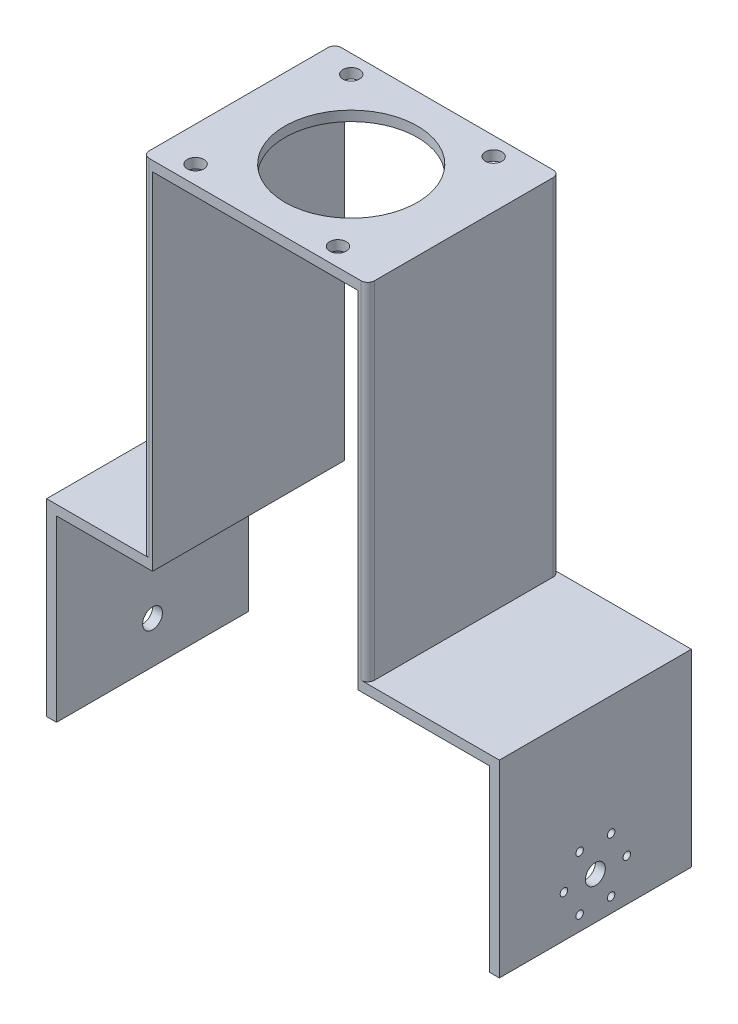
ISO-10303-21;
HEADER;
FILE_DESCRIPTION(('STEP AP214'),'2;1');
FILE_NAME('part.step','',(''),(''),'','','');
FILE_SCHEMA(('AUTOMOTIVE_DESIGN { 1 0 10303 214 1 1 1 1 }'));
ENDSEC;
DATA;
#1=APPLICATION_CONTEXT('core data for automotive mechanical design processes');
#2=APPLICATION_PROTOCOL_DEFINITION('international standard','automotive_design',2000,#1);
#3=PRODUCT_CONTEXT('',#1,'mechanical');
#4=PRODUCT('Part','Part','',(#3));
#5=PRODUCT_RELATED_PRODUCT_CATEGORY('part','',(#4));
#6=PRODUCT_DEFINITION_FORMATION('','',#4);
#7=PRODUCT_DEFINITION_CONTEXT('part definition',#1,'design');
#8=PRODUCT_DEFINITION('design','',#6,#7);
#9=PRODUCT_DEFINITION_SHAPE('','',#8);
#10=(LENGTH_UNIT() NAMED_UNIT(*) SI_UNIT(.MILLI.,.METRE.));
#11=(NAMED_UNIT(*) PLANE_ANGLE_UNIT() SI_UNIT($,.RADIAN.));
#12=(NAMED_UNIT(*) SI_UNIT($,.STERADIAN.) SOLID_ANGLE_UNIT());
#13=UNCERTAINTY_MEASURE_WITH_UNIT(LENGTH_MEASURE(1.E-05),#10,'distance_accuracy_value','');
#14=(GEOMETRIC_REPRESENTATION_CONTEXT(3) GLOBAL_UNCERTAINTY_ASSIGNED_CONTEXT((#13)) GLOBAL_UNIT_ASSIGNED_CONTEXT((#10,
#11,#12)) REPRESENTATION_CONTEXT('',''));
#15=CARTESIAN_POINT('',(0.,0.,0.));
#16=DIRECTION('',(0.,0.,1.));
#17=DIRECTION('',(1.,0.,0.));
#18=AXIS2_PLACEMENT_3D('',#15,#16,#17);
#19=CARTESIAN_POINT('',(-32.,51.8967154618484,58.));
#20=DIRECTION('',(1.,0.,0.));
#21=DIRECTION('',(0.,1.,0.));
#22=AXIS2_PLACEMENT_3D('',#19,#20,#21);
#23=PLANE('',#22);
#24=DIRECTION('',(0.,0.,-1.));
#25=VECTOR('',#24,1.);
#26=CARTESIAN_POINT('',(-32.,-52.6032845381516,58.));
#27=LINE('',#26,#25);
#28=CARTESIAN_POINT('',(-32.,-52.6032845381516,56.));
#29=VERTEX_POINT('',#28);
#30=CARTESIAN_POINT('',(-32.,-52.6032845381516,2.00000000000002));
#31=VERTEX_POINT('',#30);
#32=EDGE_CURVE('E187',#29,#31,#27,.T.);
#33=ORIENTED_EDGE('',*,*,#32,.F.);
#34=DIRECTION('',(0.,-1.,0.));
#35=VECTOR('',#34,1.);
#36=CARTESIAN_POINT('',(-32.,51.8967154618484,56.));
#37=LINE('',#36,#35);
#38=CARTESIAN_POINT('',(-32.,51.8967154618484,56.));
#39=VERTEX_POINT('',#38);
#40=EDGE_CURVE('E55',#29,#39,#37,.F.);
#41=ORIENTED_EDGE('',*,*,#40,.T.);
#42=DIRECTION('',(0.,0.,-1.));
#43=VECTOR('',#42,1.);
#44=CARTESIAN_POINT('',(-32.,51.8967154618484,58.));
#45=LINE('',#44,#43);
#46=CARTESIAN_POINT('',(-32.,51.8967154618484,2.00000000000002));
#47=VERTEX_POINT('',#46);
#48=EDGE_CURVE('E286',#39,#47,#45,.T.);
#49=ORIENTED_EDGE('',*,*,#48,.T.);
#50=DIRECTION('',(0.,-1.,0.));
#51=VECTOR('',#50,1.);
#52=CARTESIAN_POINT('',(-32.,51.8967154618484,2.));
#53=LINE('',#52,#51);
#54=EDGE_CURVE('E318',#47,#31,#53,.T.);
#55=ORIENTED_EDGE('',*,*,#54,.T.);
#56=EDGE_LOOP('',(#33,#41,#49,#55));
#57=FACE_BOUND('',#56,.T.);
#58=ADVANCED_FACE('F35',(#57),#23,.F.);
#59=CARTESIAN_POINT('',(-32.,-52.6032845381516,58.));
#60=DIRECTION('',(0.,-1.,0.));
#61=DIRECTION('',(1.,0.,0.));
#62=AXIS2_PLACEMENT_3D('',#59,#60,#61);
#63=PLANE('',#62);
#64=DIRECTION('',(-1.,0.,0.));
#65=VECTOR('',#64,1.);
#66=CARTESIAN_POINT('',(-32.,-52.6032845381516,0.));
#67=LINE('',#66,#65);
#68=CARTESIAN_POINT('',(-30.,-52.6032845381516,0.));
#69=VERTEX_POINT('',#68);
#70=CARTESIAN_POINT('',(-61.,-52.6032845381516,0.));
#71=VERTEX_POINT('',#70);
#72=EDGE_CURVE('E184',#69,#71,#67,.T.);
#73=ORIENTED_EDGE('',*,*,#72,.T.);
#74=DIRECTION('',(0.,0.,-1.));
#75=VECTOR('',#74,1.);
#76=CARTESIAN_POINT('',(-61.,-52.6032845381516,58.));
#77=LINE('',#76,#75);
#78=CARTESIAN_POINT('',(-61.,-52.6032845381516,58.));
#79=VERTEX_POINT('',#78);
#80=EDGE_CURVE('E181',#79,#71,#77,.T.);
#81=ORIENTED_EDGE('',*,*,#80,.F.);
#82=DIRECTION('',(-1.,0.,0.));
#83=VECTOR('',#82,1.);
#84=CARTESIAN_POINT('',(-32.,-52.6032845381516,58.));
#85=LINE('',#84,#83);
#86=CARTESIAN_POINT('',(-30.,-52.6032845381516,58.));
#87=VERTEX_POINT('',#86);
#88=EDGE_CURVE('E169',#87,#79,#85,.T.);
#89=ORIENTED_EDGE('',*,*,#88,.F.);
#90=CARTESIAN_POINT('',(-30.,-52.6032845381516,56.));
#91=DIRECTION('',(0.,-1.,0.));
#92=DIRECTION('',(1.,0.,0.));
#93=AXIS2_PLACEMENT_3D('',#90,#91,#92);
#94=CIRCLE('',#93,2.);
#95=EDGE_CURVE('E11',#87,#29,#94,.T.);
#96=ORIENTED_EDGE('',*,*,#95,.T.);
#97=ORIENTED_EDGE('',*,*,#32,.T.);
#98=CARTESIAN_POINT('',(-30.,-52.6032845381516,2.));
#99=DIRECTION('',(0.,-1.,0.));
#100=DIRECTION('',(1.,0.,0.));
#101=AXIS2_PLACEMENT_3D('',#98,#99,#100);
#102=CIRCLE('',#101,2.);
#103=EDGE_CURVE('E326',#31,#69,#102,.T.);
#104=ORIENTED_EDGE('',*,*,#103,.T.);
#105=EDGE_LOOP('',(#73,#81,#89,#96,#97,#104));
#106=FACE_BOUND('',#105,.T.);
#107=ADVANCED_FACE('F182',(#106),#63,.F.);
#108=CARTESIAN_POINT('',(-61.,-52.6032845381516,58.));
#109=DIRECTION('',(1.,0.,0.));
#110=DIRECTION('',(0.,0.,-1.));
#111=AXIS2_PLACEMENT_3D('',#108,#109,#110);
#112=PLANE('',#111);
#113=CARTESIAN_POINT('',(-61.,-96.9032845381516,29.));
#114=DIRECTION('',(-1.,0.,0.));
#115=DIRECTION('',(0.,0.,1.));
#116=AXIS2_PLACEMENT_3D('',#113,#114,#115);
#117=CIRCLE('',#116,3.);
#118=CARTESIAN_POINT('',(-61.,-96.9032845381516,32.));
#119=VERTEX_POINT('',#118);
#120=EDGE_CURVE('E293',#119,#119,#117,.T.);
#121=ORIENTED_EDGE('',*,*,#120,.F.);
#122=EDGE_LOOP('',(#121));
#123=FACE_BOUND('',#122,.T.);
#124=DIRECTION('',(0.,-1.,0.));
#125=VECTOR('',#124,1.);
#126=CARTESIAN_POINT('',(-61.,-52.6032845381516,0.));
#127=LINE('',#126,#125);
#128=CARTESIAN_POINT('',(-61.,-109.603284538152,0.));
#129=VERTEX_POINT('',#128);
#130=EDGE_CURVE('E220',#71,#129,#127,.T.);
#131=ORIENTED_EDGE('',*,*,#130,.T.);
#132=DIRECTION('',(0.,0.,-1.));
#133=VECTOR('',#132,1.);
#134=CARTESIAN_POINT('',(-61.,-109.603284538152,58.));
#135=LINE('',#134,#133);
#136=CARTESIAN_POINT('',(-61.,-109.603284538152,58.));
#137=VERTEX_POINT('',#136);
#138=EDGE_CURVE('E188',#137,#129,#135,.T.);
#139=ORIENTED_EDGE('',*,*,#138,.F.);
#140=DIRECTION('',(0.,-1.,0.));
#141=VECTOR('',#140,1.);
#142=CARTESIAN_POINT('',(-61.,-52.6032845381516,58.));
#143=LINE('',#142,#141);
#144=EDGE_CURVE('E174',#79,#137,#143,.T.);
#145=ORIENTED_EDGE('',*,*,#144,.F.);
#146=ORIENTED_EDGE('',*,*,#80,.T.);
#147=EDGE_LOOP('',(#131,#139,#145,#146));
#148=FACE_BOUND('',#147,.T.);
#149=ADVANCED_FACE('F190',(#123,#148),#112,.F.);
#150=CARTESIAN_POINT('',(-61.,-109.603284538152,58.));
#151=DIRECTION('',(0.,1.,0.));
#152=DIRECTION('',(0.,0.,1.));
#153=AXIS2_PLACEMENT_3D('',#150,#151,#152);
#154=PLANE('',#153);
#155=DIRECTION('',(1.,0.,0.));
#156=VECTOR('',#155,1.);
#157=CARTESIAN_POINT('',(-61.,-109.603284538152,0.));
#158=LINE('',#157,#156);
#159=CARTESIAN_POINT('',(-58.,-109.603284538152,0.));
#160=VERTEX_POINT('',#159);
#161=EDGE_CURVE('E223',#129,#160,#158,.T.);
#162=ORIENTED_EDGE('',*,*,#161,.T.);
#163=DIRECTION('',(0.,0.,-1.));
#164=VECTOR('',#163,1.);
#165=CARTESIAN_POINT('',(-58.,-109.603284538152,58.));
#166=LINE('',#165,#164);
#167=CARTESIAN_POINT('',(-58.,-109.603284538152,58.));
#168=VERTEX_POINT('',#167);
#169=EDGE_CURVE('E281',#168,#160,#166,.T.);
#170=ORIENTED_EDGE('',*,*,#169,.F.);
#171=DIRECTION('',(1.,0.,0.));
#172=VECTOR('',#171,1.);
#173=CARTESIAN_POINT('',(-61.,-109.603284538152,58.));
#174=LINE('',#173,#172);
#175=EDGE_CURVE('E193',#137,#168,#174,.T.);
#176=ORIENTED_EDGE('',*,*,#175,.F.);
#177=ORIENTED_EDGE('',*,*,#138,.T.);
#178=EDGE_LOOP('',(#162,#170,#176,#177));
#179=FACE_BOUND('',#178,.T.);
#180=ADVANCED_FACE('F391',(#179),#154,.F.);
#181=CARTESIAN_POINT('',(-58.,-55.6032845381516,58.));
#182=DIRECTION('',(-1.,0.,0.));
#183=DIRECTION('',(0.,0.,1.));
#184=AXIS2_PLACEMENT_3D('',#181,#182,#183);
#185=PLANE('',#184);
#186=CARTESIAN_POINT('',(-58.,-96.9032845381516,29.));
#187=DIRECTION('',(-1.,0.,0.));
#188=DIRECTION('',(0.,0.,1.));
#189=AXIS2_PLACEMENT_3D('',#186,#187,#188);
#190=CIRCLE('',#189,3.);
#191=CARTESIAN_POINT('',(-58.,-96.9032845381516,32.));
#192=VERTEX_POINT('',#191);
#193=EDGE_CURVE('E289',#192,#192,#190,.T.);
#194=ORIENTED_EDGE('',*,*,#193,.T.);
#195=EDGE_LOOP('',(#194));
#196=FACE_BOUND('',#195,.T.);
#197=DIRECTION('',(0.,1.,0.));
#198=VECTOR('',#197,1.);
#199=CARTESIAN_POINT('',(-58.,-55.6032845381516,0.));
#200=LINE('',#199,#198);
#201=CARTESIAN_POINT('',(-58.,-55.6032845381516,0.));
#202=VERTEX_POINT('',#201);
#203=EDGE_CURVE('E225',#160,#202,#200,.T.);
#204=ORIENTED_EDGE('',*,*,#203,.T.);
#205=DIRECTION('',(0.,0.,-1.));
#206=VECTOR('',#205,1.);
#207=CARTESIAN_POINT('',(-58.,-55.6032845381516,58.));
#208=LINE('',#207,#206);
#209=CARTESIAN_POINT('',(-58.,-55.6032845381516,58.));
#210=VERTEX_POINT('',#209);
#211=EDGE_CURVE('E278',#210,#202,#208,.T.);
#212=ORIENTED_EDGE('',*,*,#211,.F.);
#213=DIRECTION('',(0.,1.,0.));
#214=VECTOR('',#213,1.);
#215=CARTESIAN_POINT('',(-58.,-55.6032845381516,58.));
#216=LINE('',#215,#214);
#217=EDGE_CURVE('E195',#168,#210,#216,.T.);
#218=ORIENTED_EDGE('',*,*,#217,.F.);
#219=ORIENTED_EDGE('',*,*,#169,.T.);
#220=EDGE_LOOP('',(#204,#212,#218,#219));
#221=FACE_BOUND('',#220,.T.);
#222=ADVANCED_FACE('F398',(#196,#221),#185,.F.);
#223=CARTESIAN_POINT('',(-29.,-55.6032845381516,58.));
#224=DIRECTION('',(0.,1.,0.));
#225=DIRECTION('',(-1.,0.,0.));
#226=AXIS2_PLACEMENT_3D('',#223,#224,#225);
#227=PLANE('',#226);
#228=DIRECTION('',(1.,0.,0.));
#229=VECTOR('',#228,1.);
#230=CARTESIAN_POINT('',(-29.,-55.6032845381516,0.));
#231=LINE('',#230,#229);
#232=CARTESIAN_POINT('',(-29.,-55.6032845381516,0.));
#233=VERTEX_POINT('',#232);
#234=EDGE_CURVE('E227',#202,#233,#231,.T.);
#235=ORIENTED_EDGE('',*,*,#234,.T.);
#236=DIRECTION('',(0.,0.,-1.));
#237=VECTOR('',#236,1.);
#238=CARTESIAN_POINT('',(-29.,-55.6032845381516,58.));
#239=LINE('',#238,#237);
#240=CARTESIAN_POINT('',(-29.,-55.6032845381516,58.));
#241=VERTEX_POINT('',#240);
#242=EDGE_CURVE('E275',#241,#233,#239,.T.);
#243=ORIENTED_EDGE('',*,*,#242,.F.);
#244=DIRECTION('',(1.,0.,0.));
#245=VECTOR('',#244,1.);
#246=CARTESIAN_POINT('',(-29.,-55.6032845381516,58.));
#247=LINE('',#246,#245);
#248=EDGE_CURVE('E200',#210,#241,#247,.T.);
#249=ORIENTED_EDGE('',*,*,#248,.F.);
#250=ORIENTED_EDGE('',*,*,#211,.T.);
#251=EDGE_LOOP('',(#235,#243,#249,#250));
#252=FACE_BOUND('',#251,.T.);
#253=ADVANCED_FACE('F401',(#252),#227,.F.);
#254=CARTESIAN_POINT('',(-29.,48.8967154618484,58.));
#255=DIRECTION('',(-1.,0.,0.));
#256=DIRECTION('',(0.,-1.,0.));
#257=AXIS2_PLACEMENT_3D('',#254,#255,#256);
#258=PLANE('',#257);
#259=DIRECTION('',(0.,1.,0.));
#260=VECTOR('',#259,1.);
#261=CARTESIAN_POINT('',(-29.,48.8967154618484,0.));
#262=LINE('',#261,#260);
#263=CARTESIAN_POINT('',(-29.,48.8967154618484,0.));
#264=VERTEX_POINT('',#263);
#265=EDGE_CURVE('E229',#233,#264,#262,.T.);
#266=ORIENTED_EDGE('',*,*,#265,.T.);
#267=DIRECTION('',(0.,0.,-1.));
#268=VECTOR('',#267,1.);
#269=CARTESIAN_POINT('',(-29.,48.8967154618484,58.));
#270=LINE('',#269,#268);
#271=CARTESIAN_POINT('',(-29.,48.8967154618484,58.));
#272=VERTEX_POINT('',#271);
#273=EDGE_CURVE('E272',#272,#264,#270,.T.);
#274=ORIENTED_EDGE('',*,*,#273,.F.);
#275=DIRECTION('',(0.,1.,0.));
#276=VECTOR('',#275,1.);
#277=CARTESIAN_POINT('',(-29.,48.8967154618484,58.));
#278=LINE('',#277,#276);
#279=EDGE_CURVE('E202',#241,#272,#278,.T.);
#280=ORIENTED_EDGE('',*,*,#279,.F.);
#281=ORIENTED_EDGE('',*,*,#242,.T.);
#282=EDGE_LOOP('',(#266,#274,#280,#281));
#283=FACE_BOUND('',#282,.T.);
#284=ADVANCED_FACE('F406',(#283),#258,.F.);
#285=CARTESIAN_POINT('',(1.99999999999999,48.8967154618484,58.));
#286=DIRECTION('',(0.,1.,0.));
#287=DIRECTION('',(0.,0.,1.));
#288=AXIS2_PLACEMENT_3D('',#285,#286,#287);
#289=PLANE('',#288);
#290=CARTESIAN_POINT('',(1.99999999999999,48.8967154618484,29.));
#291=DIRECTION('',(0.,1.,0.));
#292=DIRECTION('',(0.,0.,1.));
#293=AXIS2_PLACEMENT_3D('',#290,#291,#292);
#294=CIRCLE('',#293,20.);
#295=CARTESIAN_POINT('',(1.99999999999999,48.8967154618484,49.));
#296=VERTEX_POINT('',#295);
#297=EDGE_CURVE('E470',#296,#296,#294,.T.);
#298=ORIENTED_EDGE('',*,*,#297,.T.);
#299=EDGE_LOOP('',(#298));
#300=FACE_BOUND('',#299,.T.);
#301=CARTESIAN_POINT('',(-21.5,48.8967154618484,52.5));
#302=DIRECTION('',(0.,1.,0.));
#303=DIRECTION('',(0.,0.,1.));
#304=AXIS2_PLACEMENT_3D('',#301,#302,#303);
#305=CIRCLE('',#304,2.5);
#306=CARTESIAN_POINT('',(-21.5,48.8967154618484,55.));
#307=VERTEX_POINT('',#306);
#308=EDGE_CURVE('E476',#307,#307,#305,.T.);
#309=ORIENTED_EDGE('',*,*,#308,.T.);
#310=EDGE_LOOP('',(#309));
#311=FACE_BOUND('',#310,.T.);
#312=CARTESIAN_POINT('',(21.5,48.8967154618484,52.5));
#313=DIRECTION('',(0.,1.,0.));
#314=DIRECTION('',(0.,0.,1.));
#315=AXIS2_PLACEMENT_3D('',#312,#313,#314);
#316=CIRCLE('',#315,2.5);
#317=CARTESIAN_POINT('',(21.5,48.8967154618484,55.));
#318=VERTEX_POINT('',#317);
#319=EDGE_CURVE('E482',#318,#318,#316,.T.);
#320=ORIENTED_EDGE('',*,*,#319,.T.);
#321=EDGE_LOOP('',(#320));
#322=FACE_BOUND('',#321,.T.);
#323=CARTESIAN_POINT('',(21.5,48.8967154618484,5.49999999999999));
#324=DIRECTION('',(0.,1.,0.));
#325=DIRECTION('',(0.,0.,1.));
#326=AXIS2_PLACEMENT_3D('',#323,#324,#325);
#327=CIRCLE('',#326,2.5);
#328=CARTESIAN_POINT('',(21.5,48.8967154618484,7.99999999999999));
#329=VERTEX_POINT('',#328);
#330=EDGE_CURVE('E488',#329,#329,#327,.T.);
#331=ORIENTED_EDGE('',*,*,#330,.T.);
#332=EDGE_LOOP('',(#331));
#333=FACE_BOUND('',#332,.T.);
#334=CARTESIAN_POINT('',(-21.5,48.8967154618484,5.5));
#335=DIRECTION('',(0.,1.,0.));
#336=DIRECTION('',(0.,0.,1.));
#337=AXIS2_PLACEMENT_3D('',#334,#335,#336);
#338=CIRCLE('',#337,2.5);
#339=CARTESIAN_POINT('',(-21.5,48.8967154618484,8.));
#340=VERTEX_POINT('',#339);
#341=EDGE_CURVE('E221',#340,#340,#338,.T.);
#342=ORIENTED_EDGE('',*,*,#341,.T.);
#343=EDGE_LOOP('',(#342));
#344=FACE_BOUND('',#343,.T.);
#345=DIRECTION('',(1.,0.,0.));
#346=VECTOR('',#345,1.);
#347=CARTESIAN_POINT('',(1.99999999999999,48.8967154618484,0.));
#348=LINE('',#347,#346);
#349=CARTESIAN_POINT('',(33.,48.8967154618484,0.));
#350=VERTEX_POINT('',#349);
#351=EDGE_CURVE('E232',#264,#350,#348,.T.);
#352=ORIENTED_EDGE('',*,*,#351,.T.);
#353=DIRECTION('',(0.,0.,-1.));
#354=VECTOR('',#353,1.);
#355=CARTESIAN_POINT('',(33.,48.8967154618484,58.));
#356=LINE('',#355,#354);
#357=CARTESIAN_POINT('',(33.,48.8967154618484,58.));
#358=VERTEX_POINT('',#357);
#359=EDGE_CURVE('E269',#358,#350,#356,.T.);
#360=ORIENTED_EDGE('',*,*,#359,.F.);
#361=DIRECTION('',(1.,0.,0.));
#362=VECTOR('',#361,1.);
#363=CARTESIAN_POINT('',(1.99999999999999,48.8967154618484,58.));
#364=LINE('',#363,#362);
#365=EDGE_CURVE('E204',#272,#358,#364,.T.);
#366=ORIENTED_EDGE('',*,*,#365,.F.);
#367=ORIENTED_EDGE('',*,*,#273,.T.);
#368=EDGE_LOOP('',(#352,#360,#366,#367));
#369=FACE_BOUND('',#368,.T.);
#370=ADVANCED_FACE('F412',(#300,#311,#322,#333,#344,#369),#289,.F.);
#371=CARTESIAN_POINT('',(33.,48.8967154618484,58.));
#372=DIRECTION('',(1.,0.,0.));
#373=DIRECTION('',(0.,1.,0.));
#374=AXIS2_PLACEMENT_3D('',#371,#372,#373);
#375=PLANE('',#374);
#376=DIRECTION('',(0.,-1.,0.));
#377=VECTOR('',#376,1.);
#378=CARTESIAN_POINT('',(33.,48.8967154618484,0.));
#379=LINE('',#378,#377);
#380=CARTESIAN_POINT('',(33.,-55.6032845381516,0.));
#381=VERTEX_POINT('',#380);
#382=EDGE_CURVE('E234',#350,#381,#379,.T.);
#383=ORIENTED_EDGE('',*,*,#382,.T.);
#384=DIRECTION('',(0.,0.,-1.));
#385=VECTOR('',#384,1.);
#386=CARTESIAN_POINT('',(33.,-55.6032845381516,58.));
#387=LINE('',#386,#385);
#388=CARTESIAN_POINT('',(33.,-55.6032845381516,58.));
#389=VERTEX_POINT('',#388);
#390=EDGE_CURVE('E266',#389,#381,#387,.T.);
#391=ORIENTED_EDGE('',*,*,#390,.F.);
#392=DIRECTION('',(0.,-1.,0.));
#393=VECTOR('',#392,1.);
#394=CARTESIAN_POINT('',(33.,48.8967154618484,58.));
#395=LINE('',#394,#393);
#396=EDGE_CURVE('E206',#358,#389,#395,.T.);
#397=ORIENTED_EDGE('',*,*,#396,.F.);
#398=ORIENTED_EDGE('',*,*,#359,.T.);
#399=EDGE_LOOP('',(#383,#391,#397,#398));
#400=FACE_BOUND('',#399,.T.);
#401=ADVANCED_FACE('F415',(#400),#375,.F.);
#402=CARTESIAN_POINT('',(33.,-55.6032845381516,58.));
#403=DIRECTION('',(0.,1.,0.));
#404=DIRECTION('',(0.,0.,1.));
#405=AXIS2_PLACEMENT_3D('',#402,#403,#404);
#406=PLANE('',#405);
#407=DIRECTION('',(1.,0.,0.));
#408=VECTOR('',#407,1.);
#409=CARTESIAN_POINT('',(33.,-55.6032845381516,0.));
#410=LINE('',#409,#408);
#411=CARTESIAN_POINT('',(72.75,-55.6032845381516,0.));
#412=VERTEX_POINT('',#411);
#413=EDGE_CURVE('E236',#381,#412,#410,.T.);
#414=ORIENTED_EDGE('',*,*,#413,.T.);
#415=DIRECTION('',(0.,0.,-1.));
#416=VECTOR('',#415,1.);
#417=CARTESIAN_POINT('',(72.75,-55.6032845381516,58.));
#418=LINE('',#417,#416);
#419=CARTESIAN_POINT('',(72.75,-55.6032845381516,58.));
#420=VERTEX_POINT('',#419);
#421=EDGE_CURVE('E263',#420,#412,#418,.T.);
#422=ORIENTED_EDGE('',*,*,#421,.F.);
#423=DIRECTION('',(1.,0.,0.));
#424=VECTOR('',#423,1.);
#425=CARTESIAN_POINT('',(33.,-55.6032845381516,58.));
#426=LINE('',#425,#424);
#427=EDGE_CURVE('E208',#389,#420,#426,.T.);
#428=ORIENTED_EDGE('',*,*,#427,.F.);
#429=ORIENTED_EDGE('',*,*,#390,.T.);
#430=EDGE_LOOP('',(#414,#422,#428,#429));
#431=FACE_BOUND('',#430,.T.);
#432=ADVANCED_FACE('F420',(#431),#406,.F.);
#433=CARTESIAN_POINT('',(72.75,-55.6032845381516,58.));
#434=DIRECTION('',(1.,0.,0.));
#435=DIRECTION('',(0.,1.,0.));
#436=AXIS2_PLACEMENT_3D('',#433,#434,#435);
#437=PLANE('',#436);
#438=CARTESIAN_POINT('',(72.75,-96.9024399232907,29.));
#439=DIRECTION('',(1.,0.,0.));
#440=DIRECTION('',(0.,1.,0.));
#441=AXIS2_PLACEMENT_3D('',#438,#439,#440);
#442=CIRCLE('',#441,3.);
#443=CARTESIAN_POINT('',(72.75,-93.9024399232907,29.));
#444=VERTEX_POINT('',#443);
#445=EDGE_CURVE('E819',#444,#444,#442,.T.);
#446=ORIENTED_EDGE('',*,*,#445,.T.);
#447=EDGE_LOOP('',(#446));
#448=FACE_BOUND('',#447,.T.);
#449=CARTESIAN_POINT('',(72.75,-96.9024399232907,19.5));
#450=DIRECTION('',(1.,0.,0.));
#451=DIRECTION('',(0.,1.,0.));
#452=AXIS2_PLACEMENT_3D('',#449,#450,#451);
#453=CIRCLE('',#452,1.13029999999999);
#454=CARTESIAN_POINT('',(72.75,-95.7721399232907,19.5));
#455=VERTEX_POINT('',#454);
#456=EDGE_CURVE('E294',#455,#455,#453,.T.);
#457=ORIENTED_EDGE('',*,*,#456,.T.);
#458=EDGE_LOOP('',(#457));
#459=FACE_BOUND('',#458,.T.);
#460=CARTESIAN_POINT('',(72.75,-105.129681259243,24.2499999999996));
#461=DIRECTION('',(1.,0.,0.));
#462=DIRECTION('',(0.,1.,0.));
#463=AXIS2_PLACEMENT_3D('',#460,#461,#462);
#464=CIRCLE('',#463,1.13029999999999);
#465=CARTESIAN_POINT('',(72.75,-103.999381259243,24.2499999999996));
#466=VERTEX_POINT('',#465);
#467=EDGE_CURVE('E812',#466,#466,#464,.T.);
#468=ORIENTED_EDGE('',*,*,#467,.T.);
#469=EDGE_LOOP('',(#468));
#470=FACE_BOUND('',#469,.T.);
#471=CARTESIAN_POINT('',(72.75,-105.129681259244,33.7499999999996));
#472=DIRECTION('',(1.,0.,0.));
#473=DIRECTION('',(0.,1.,0.));
#474=AXIS2_PLACEMENT_3D('',#471,#472,#473);
#475=CIRCLE('',#474,1.13029999999999);
#476=CARTESIAN_POINT('',(72.75,-103.999381259244,33.7499999999996));
#477=VERTEX_POINT('',#476);
#478=EDGE_CURVE('E806',#477,#477,#475,.T.);
#479=ORIENTED_EDGE('',*,*,#478,.T.);
#480=EDGE_LOOP('',(#479));
#481=FACE_BOUND('',#480,.T.);
#482=CARTESIAN_POINT('',(72.75,-96.9024399232916,38.5));
#483=DIRECTION('',(1.,0.,0.));
#484=DIRECTION('',(0.,1.,0.));
#485=AXIS2_PLACEMENT_3D('',#482,#483,#484);
#486=CIRCLE('',#485,1.13029999999999);
#487=CARTESIAN_POINT('',(72.75,-95.7721399232916,38.5));
#488=VERTEX_POINT('',#487);
#489=EDGE_CURVE('E800',#488,#488,#486,.T.);
#490=ORIENTED_EDGE('',*,*,#489,.T.);
#491=EDGE_LOOP('',(#490));
#492=FACE_BOUND('',#491,.T.);
#493=CARTESIAN_POINT('',(72.75,-88.6751985873392,33.7500000000003));
#494=DIRECTION('',(1.,0.,0.));
#495=DIRECTION('',(0.,1.,0.));
#496=AXIS2_PLACEMENT_3D('',#493,#494,#495);
#497=CIRCLE('',#496,1.13029999999999);
#498=CARTESIAN_POINT('',(72.75,-87.5448985873392,33.7500000000003));
#499=VERTEX_POINT('',#498);
#500=EDGE_CURVE('E793',#499,#499,#497,.T.);
#501=ORIENTED_EDGE('',*,*,#500,.T.);
#502=EDGE_LOOP('',(#501));
#503=FACE_BOUND('',#502,.T.);
#504=CARTESIAN_POINT('',(72.75,-88.6751985873388,24.2500000000003));
#505=DIRECTION('',(1.,0.,0.));
#506=DIRECTION('',(0.,1.,0.));
#507=AXIS2_PLACEMENT_3D('',#504,#505,#506);
#508=CIRCLE('',#507,1.13029999999999);
#509=CARTESIAN_POINT('',(72.75,-87.5448985873388,24.2500000000003));
#510=VERTEX_POINT('',#509);
#511=EDGE_CURVE('E461',#510,#510,#508,.T.);
#512=ORIENTED_EDGE('',*,*,#511,.T.);
#513=EDGE_LOOP('',(#512));
#514=FACE_BOUND('',#513,.T.);
#515=DIRECTION('',(0.,-1.,0.));
#516=VECTOR('',#515,1.);
#517=CARTESIAN_POINT('',(72.75,-55.6032845381516,0.));
#518=LINE('',#517,#516);
#519=CARTESIAN_POINT('',(72.75,-109.603284538152,0.));
#520=VERTEX_POINT('',#519);
#521=EDGE_CURVE('E238',#412,#520,#518,.T.);
#522=ORIENTED_EDGE('',*,*,#521,.T.);
#523=DIRECTION('',(0.,0.,-1.));
#524=VECTOR('',#523,1.);
#525=CARTESIAN_POINT('',(72.75,-109.603284538152,58.));
#526=LINE('',#525,#524);
#527=CARTESIAN_POINT('',(72.75,-109.603284538152,58.));
#528=VERTEX_POINT('',#527);
#529=EDGE_CURVE('E260',#528,#520,#526,.T.);
#530=ORIENTED_EDGE('',*,*,#529,.F.);
#531=DIRECTION('',(0.,-1.,0.));
#532=VECTOR('',#531,1.);
#533=CARTESIAN_POINT('',(72.75,-55.6032845381516,58.));
#534=LINE('',#533,#532);
#535=EDGE_CURVE('E210',#420,#528,#534,.T.);
#536=ORIENTED_EDGE('',*,*,#535,.F.);
#537=ORIENTED_EDGE('',*,*,#421,.T.);
#538=EDGE_LOOP('',(#522,#530,#536,#537));
#539=FACE_BOUND('',#538,.T.);
#540=ADVANCED_FACE('F424',(#448,#459,#470,#481,#492,#503,#514,#539),#437,.F.);
#541=CARTESIAN_POINT('',(72.75,-109.603284538152,58.));
#542=DIRECTION('',(0.,1.,0.));
#543=DIRECTION('',(0.,0.,1.));
#544=AXIS2_PLACEMENT_3D('',#541,#542,#543);
#545=PLANE('',#544);
#546=DIRECTION('',(1.,0.,0.));
#547=VECTOR('',#546,1.);
#548=CARTESIAN_POINT('',(72.75,-109.603284538152,0.));
#549=LINE('',#548,#547);
#550=CARTESIAN_POINT('',(75.75,-109.603284538152,0.));
#551=VERTEX_POINT('',#550);
#552=EDGE_CURVE('E240',#520,#551,#549,.T.);
#553=ORIENTED_EDGE('',*,*,#552,.T.);
#554=DIRECTION('',(0.,0.,-1.));
#555=VECTOR('',#554,1.);
#556=CARTESIAN_POINT('',(75.75,-109.603284538152,58.));
#557=LINE('',#556,#555);
#558=CARTESIAN_POINT('',(75.75,-109.603284538152,58.));
#559=VERTEX_POINT('',#558);
#560=EDGE_CURVE('E257',#559,#551,#557,.T.);
#561=ORIENTED_EDGE('',*,*,#560,.F.);
#562=DIRECTION('',(1.,0.,0.));
#563=VECTOR('',#562,1.);
#564=CARTESIAN_POINT('',(72.75,-109.603284538152,58.));
#565=LINE('',#564,#563);
#566=EDGE_CURVE('E212',#528,#559,#565,.T.);
#567=ORIENTED_EDGE('',*,*,#566,.F.);
#568=ORIENTED_EDGE('',*,*,#529,.T.);
#569=EDGE_LOOP('',(#553,#561,#567,#568));
#570=FACE_BOUND('',#569,.T.);
#571=ADVANCED_FACE('F426',(#570),#545,.F.);
#572=CARTESIAN_POINT('',(75.75,-52.6032845381516,58.));
#573=DIRECTION('',(-1.,0.,0.));
#574=DIRECTION('',(0.,-1.,0.));
#575=AXIS2_PLACEMENT_3D('',#572,#573,#574);
#576=PLANE('',#575);
#577=CARTESIAN_POINT('',(75.7500000000001,-96.9024399232907,29.));
#578=DIRECTION('',(1.,0.,0.));
#579=DIRECTION('',(0.,1.,0.));
#580=AXIS2_PLACEMENT_3D('',#577,#578,#579);
#581=CIRCLE('',#580,3.);
#582=CARTESIAN_POINT('',(75.7500000000001,-93.9024399232907,29.));
#583=VERTEX_POINT('',#582);
#584=EDGE_CURVE('E822',#583,#583,#581,.T.);
#585=ORIENTED_EDGE('',*,*,#584,.F.);
#586=EDGE_LOOP('',(#585));
#587=FACE_BOUND('',#586,.T.);
#588=CARTESIAN_POINT('',(75.7500000000001,-96.9024399232907,19.5));
#589=DIRECTION('',(1.,0.,0.));
#590=DIRECTION('',(0.,0.,-1.));
#591=AXIS2_PLACEMENT_3D('',#588,#589,#590);
#592=CIRCLE('',#591,1.13029999999999);
#593=CARTESIAN_POINT('',(75.7500000000001,-96.9024399232907,18.3697));
#594=VERTEX_POINT('',#593);
#595=EDGE_CURVE('E298',#594,#594,#592,.T.);
#596=ORIENTED_EDGE('',*,*,#595,.F.);
#597=EDGE_LOOP('',(#596));
#598=FACE_BOUND('',#597,.T.);
#599=CARTESIAN_POINT('',(75.7500000000001,-105.129681259243,24.2499999999996));
#600=DIRECTION('',(1.,0.,0.));
#601=DIRECTION('',(0.,0.,-1.));
#602=AXIS2_PLACEMENT_3D('',#599,#600,#601);
#603=CIRCLE('',#602,1.13029999999999);
#604=CARTESIAN_POINT('',(75.7500000000001,-105.129681259243,23.1196999999996));
#605=VERTEX_POINT('',#604);
#606=EDGE_CURVE('E297',#605,#605,#603,.T.);
#607=ORIENTED_EDGE('',*,*,#606,.F.);
#608=EDGE_LOOP('',(#607));
#609=FACE_BOUND('',#608,.T.);
#610=CARTESIAN_POINT('',(75.7500000000001,-105.129681259244,33.7499999999996));
#611=DIRECTION('',(1.,0.,0.));
#612=DIRECTION('',(0.,0.,-1.));
#613=AXIS2_PLACEMENT_3D('',#610,#611,#612);
#614=CIRCLE('',#613,1.13029999999999);
#615=CARTESIAN_POINT('',(75.7500000000001,-105.129681259244,32.6196999999996));
#616=VERTEX_POINT('',#615);
#617=EDGE_CURVE('E809',#616,#616,#614,.T.);
#618=ORIENTED_EDGE('',*,*,#617,.F.);
#619=EDGE_LOOP('',(#618));
#620=FACE_BOUND('',#619,.T.);
#621=CARTESIAN_POINT('',(75.7500000000001,-96.9024399232916,38.5));
#622=DIRECTION('',(1.,0.,0.));
#623=DIRECTION('',(0.,0.,-1.));
#624=AXIS2_PLACEMENT_3D('',#621,#622,#623);
#625=CIRCLE('',#624,1.13029999999999);
#626=CARTESIAN_POINT('',(75.7500000000001,-96.9024399232916,37.3697));
#627=VERTEX_POINT('',#626);
#628=EDGE_CURVE('E803',#627,#627,#625,.T.);
#629=ORIENTED_EDGE('',*,*,#628,.F.);
#630=EDGE_LOOP('',(#629));
#631=FACE_BOUND('',#630,.T.);
#632=CARTESIAN_POINT('',(75.7500000000001,-88.6751985873392,33.7500000000003));
#633=DIRECTION('',(1.,0.,0.));
#634=DIRECTION('',(0.,0.,-1.));
#635=AXIS2_PLACEMENT_3D('',#632,#633,#634);
#636=CIRCLE('',#635,1.13029999999999);
#637=CARTESIAN_POINT('',(75.7500000000001,-88.6751985873392,32.6197000000003));
#638=VERTEX_POINT('',#637);
#639=EDGE_CURVE('E795',#638,#638,#636,.T.);
#640=ORIENTED_EDGE('',*,*,#639,.F.);
#641=EDGE_LOOP('',(#640));
#642=FACE_BOUND('',#641,.T.);
#643=CARTESIAN_POINT('',(75.7500000000001,-88.6751985873388,24.2500000000003));
#644=DIRECTION('',(1.,0.,0.));
#645=DIRECTION('',(0.,0.,-1.));
#646=AXIS2_PLACEMENT_3D('',#643,#644,#645);
#647=CIRCLE('',#646,1.13029999999999);
#648=CARTESIAN_POINT('',(75.7500000000001,-88.6751985873388,23.1197000000003));
#649=VERTEX_POINT('',#648);
#650=EDGE_CURVE('E464',#649,#649,#647,.T.);
#651=ORIENTED_EDGE('',*,*,#650,.F.);
#652=EDGE_LOOP('',(#651));
#653=FACE_BOUND('',#652,.T.);
#654=DIRECTION('',(0.,1.,0.));
#655=VECTOR('',#654,1.);
#656=CARTESIAN_POINT('',(75.75,-52.6032845381516,0.));
#657=LINE('',#656,#655);
#658=CARTESIAN_POINT('',(75.75,-52.6032845381516,0.));
#659=VERTEX_POINT('',#658);
#660=EDGE_CURVE('E242',#551,#659,#657,.T.);
#661=ORIENTED_EDGE('',*,*,#660,.T.);
#662=DIRECTION('',(0.,0.,-1.));
#663=VECTOR('',#662,1.);
#664=CARTESIAN_POINT('',(75.75,-52.6032845381516,58.));
#665=LINE('',#664,#663);
#666=CARTESIAN_POINT('',(75.75,-52.6032845381516,58.));
#667=VERTEX_POINT('',#666);
#668=EDGE_CURVE('E254',#667,#659,#665,.T.);
#669=ORIENTED_EDGE('',*,*,#668,.F.);
#670=DIRECTION('',(0.,1.,0.));
#671=VECTOR('',#670,1.);
#672=CARTESIAN_POINT('',(75.75,-52.6032845381516,58.));
#673=LINE('',#672,#671);
#674=EDGE_CURVE('E214',#559,#667,#673,.T.);
#675=ORIENTED_EDGE('',*,*,#674,.F.);
#676=ORIENTED_EDGE('',*,*,#560,.T.);
#677=EDGE_LOOP('',(#661,#669,#675,#676));
#678=FACE_BOUND('',#677,.T.);
#679=ADVANCED_FACE('F377',(#587,#598,#609,#620,#631,#642,#653,#678),#576,.F.);
#680=CARTESIAN_POINT('',(36.,-52.6032845381516,58.));
#681=DIRECTION('',(0.,-1.,0.));
#682=DIRECTION('',(1.,0.,0.));
#683=AXIS2_PLACEMENT_3D('',#680,#681,#682);
#684=PLANE('',#683);
#685=DIRECTION('',(-1.,0.,0.));
#686=VECTOR('',#685,1.);
#687=CARTESIAN_POINT('',(36.,-52.6032845381516,0.));
#688=LINE('',#687,#686);
#689=CARTESIAN_POINT('',(34.,-52.6032845381516,0.));
#690=VERTEX_POINT('',#689);
#691=EDGE_CURVE('E244',#659,#690,#688,.T.);
#692=ORIENTED_EDGE('',*,*,#691,.T.);
#693=CARTESIAN_POINT('',(34.,-52.6032845381516,2.));
#694=DIRECTION('',(0.,-1.,0.));
#695=DIRECTION('',(1.,0.,0.));
#696=AXIS2_PLACEMENT_3D('',#693,#694,#695);
#697=CIRCLE('',#696,2.);
#698=CARTESIAN_POINT('',(36.,-52.6032845381516,2.00000000000002));
#699=VERTEX_POINT('',#698);
#700=EDGE_CURVE('E316',#690,#699,#697,.T.);
#701=ORIENTED_EDGE('',*,*,#700,.T.);
#702=DIRECTION('',(0.,0.,-1.));
#703=VECTOR('',#702,1.);
#704=CARTESIAN_POINT('',(36.,-52.6032845381516,58.));
#705=LINE('',#704,#703);
#706=CARTESIAN_POINT('',(36.,-52.6032845381516,56.));
#707=VERTEX_POINT('',#706);
#708=EDGE_CURVE('E251',#707,#699,#705,.T.);
#709=ORIENTED_EDGE('',*,*,#708,.F.);
#710=CARTESIAN_POINT('',(34.,-52.6032845381516,56.));
#711=DIRECTION('',(0.,-1.,0.));
#712=DIRECTION('',(1.,0.,0.));
#713=AXIS2_PLACEMENT_3D('',#710,#711,#712);
#714=CIRCLE('',#713,2.);
#715=CARTESIAN_POINT('',(34.,-52.6032845381516,58.));
#716=VERTEX_POINT('',#715);
#717=EDGE_CURVE('E305',#707,#716,#714,.T.);
#718=ORIENTED_EDGE('',*,*,#717,.T.);
#719=DIRECTION('',(-1.,0.,0.));
#720=VECTOR('',#719,1.);
#721=CARTESIAN_POINT('',(36.,-52.6032845381516,58.));
#722=LINE('',#721,#720);
#723=EDGE_CURVE('E216',#667,#716,#722,.T.);
#724=ORIENTED_EDGE('',*,*,#723,.F.);
#725=ORIENTED_EDGE('',*,*,#668,.T.);
#726=EDGE_LOOP('',(#692,#701,#709,#718,#724,#725));
#727=FACE_BOUND('',#726,.T.);
#728=ADVANCED_FACE('F364',(#727),#684,.F.);
#729=CARTESIAN_POINT('',(36.,51.8967154618484,58.));
#730=DIRECTION('',(-1.,0.,0.));
#731=DIRECTION('',(0.,-1.,0.));
#732=AXIS2_PLACEMENT_3D('',#729,#730,#731);
#733=PLANE('',#732);
#734=ORIENTED_EDGE('',*,*,#708,.T.);
#735=DIRECTION('',(0.,1.,0.));
#736=VECTOR('',#735,1.);
#737=CARTESIAN_POINT('',(36.,51.8967154618484,2.));
#738=LINE('',#737,#736);
#739=CARTESIAN_POINT('',(36.,51.8967154618484,2.00000000000002));
#740=VERTEX_POINT('',#739);
#741=EDGE_CURVE('E308',#699,#740,#738,.T.);
#742=ORIENTED_EDGE('',*,*,#741,.T.);
#743=DIRECTION('',(0.,0.,-1.));
#744=VECTOR('',#743,1.);
#745=CARTESIAN_POINT('',(36.,51.8967154618484,58.));
#746=LINE('',#745,#744);
#747=CARTESIAN_POINT('',(36.,51.8967154618484,56.));
#748=VERTEX_POINT('',#747);
#749=EDGE_CURVE('E218',#748,#740,#746,.T.);
#750=ORIENTED_EDGE('',*,*,#749,.F.);
#751=DIRECTION('',(0.,1.,0.));
#752=VECTOR('',#751,1.);
#753=CARTESIAN_POINT('',(36.,-52.6032845381516,56.));
#754=LINE('',#753,#752);
#755=EDGE_CURVE('E303',#748,#707,#754,.F.);
#756=ORIENTED_EDGE('',*,*,#755,.T.);
#757=EDGE_LOOP('',(#734,#742,#750,#756));
#758=FACE_BOUND('',#757,.T.);
#759=ADVANCED_FACE('F368',(#758),#733,.F.);
#760=CARTESIAN_POINT('',(1.99999999999999,51.8967154618484,58.));
#761=DIRECTION('',(0.,-1.,0.));
#762=DIRECTION('',(1.,0.,0.));
#763=AXIS2_PLACEMENT_3D('',#760,#761,#762);
#764=PLANE('',#763);
#765=CARTESIAN_POINT('',(1.99999999999999,51.8967154618484,29.));
#766=DIRECTION('',(0.,1.,0.));
#767=DIRECTION('',(0.,0.,1.));
#768=AXIS2_PLACEMENT_3D('',#765,#766,#767);
#769=CIRCLE('',#768,20.);
#770=CARTESIAN_POINT('',(1.99999999999999,51.8967154618484,49.));
#771=VERTEX_POINT('',#770);
#772=EDGE_CURVE('E292',#771,#771,#769,.T.);
#773=ORIENTED_EDGE('',*,*,#772,.F.);
#774=EDGE_LOOP('',(#773));
#775=FACE_BOUND('',#774,.T.);
#776=CARTESIAN_POINT('',(-21.5,51.8967154618484,52.5));
#777=DIRECTION('',(0.,1.,0.));
#778=DIRECTION('',(0.,0.,-1.));
#779=AXIS2_PLACEMENT_3D('',#776,#777,#778);
#780=CIRCLE('',#779,2.5);
#781=CARTESIAN_POINT('',(-21.5,51.8967154618484,50.));
#782=VERTEX_POINT('',#781);
#783=EDGE_CURVE('E473',#782,#782,#780,.T.);
#784=ORIENTED_EDGE('',*,*,#783,.F.);
#785=EDGE_LOOP('',(#784));
#786=FACE_BOUND('',#785,.T.);
#787=CARTESIAN_POINT('',(21.5,51.8967154618484,52.5));
#788=DIRECTION('',(0.,1.,0.));
#789=DIRECTION('',(0.,0.,1.));
#790=AXIS2_PLACEMENT_3D('',#787,#788,#789);
#791=CIRCLE('',#790,2.5);
#792=CARTESIAN_POINT('',(21.5,51.8967154618484,55.));
#793=VERTEX_POINT('',#792);
#794=EDGE_CURVE('E479',#793,#793,#791,.T.);
#795=ORIENTED_EDGE('',*,*,#794,.F.);
#796=EDGE_LOOP('',(#795));
#797=FACE_BOUND('',#796,.T.);
#798=CARTESIAN_POINT('',(21.5,51.8967154618484,5.49999999999999));
#799=DIRECTION('',(0.,1.,0.));
#800=DIRECTION('',(0.,0.,-1.));
#801=AXIS2_PLACEMENT_3D('',#798,#799,#800);
#802=CIRCLE('',#801,2.5);
#803=CARTESIAN_POINT('',(21.5,51.8967154618484,3.));
#804=VERTEX_POINT('',#803);
#805=EDGE_CURVE('E485',#804,#804,#802,.T.);
#806=ORIENTED_EDGE('',*,*,#805,.F.);
#807=EDGE_LOOP('',(#806));
#808=FACE_BOUND('',#807,.T.);
#809=CARTESIAN_POINT('',(-21.5,51.8967154618484,5.5));
#810=DIRECTION('',(0.,1.,0.));
#811=DIRECTION('',(0.,0.,1.));
#812=AXIS2_PLACEMENT_3D('',#809,#810,#811);
#813=CIRCLE('',#812,2.5);
#814=CARTESIAN_POINT('',(-21.5,51.8967154618484,8.));
#815=VERTEX_POINT('',#814);
#816=EDGE_CURVE('E491',#815,#815,#813,.T.);
#817=ORIENTED_EDGE('',*,*,#816,.F.);
#818=EDGE_LOOP('',(#817));
#819=FACE_BOUND('',#818,.T.);
#820=ORIENTED_EDGE('',*,*,#48,.F.);
#821=CARTESIAN_POINT('',(-30.,51.8967154618484,56.));
#822=DIRECTION('',(0.,-1.,0.));
#823=DIRECTION('',(1.,0.,0.));
#824=AXIS2_PLACEMENT_3D('',#821,#822,#823);
#825=CIRCLE('',#824,2.);
#826=CARTESIAN_POINT('',(-30.,51.8967154618484,58.));
#827=VERTEX_POINT('',#826);
#828=EDGE_CURVE('E43',#39,#827,#825,.F.);
#829=ORIENTED_EDGE('',*,*,#828,.T.);
#830=DIRECTION('',(-1.,0.,0.));
#831=VECTOR('',#830,1.);
#832=CARTESIAN_POINT('',(1.99999999999999,51.8967154618484,58.));
#833=LINE('',#832,#831);
#834=CARTESIAN_POINT('',(34.,51.8967154618484,58.));
#835=VERTEX_POINT('',#834);
#836=EDGE_CURVE('E178',#835,#827,#833,.T.);
#837=ORIENTED_EDGE('',*,*,#836,.F.);
#838=CARTESIAN_POINT('',(34.,51.8967154618484,56.));
#839=DIRECTION('',(0.,-1.,0.));
#840=DIRECTION('',(1.,0.,0.));
#841=AXIS2_PLACEMENT_3D('',#838,#839,#840);
#842=CIRCLE('',#841,2.);
#843=EDGE_CURVE('E301',#835,#748,#842,.F.);
#844=ORIENTED_EDGE('',*,*,#843,.T.);
#845=ORIENTED_EDGE('',*,*,#749,.T.);
#846=CARTESIAN_POINT('',(34.,51.8967154618484,2.));
#847=DIRECTION('',(0.,-1.,0.));
#848=DIRECTION('',(1.,0.,0.));
#849=AXIS2_PLACEMENT_3D('',#846,#847,#848);
#850=CIRCLE('',#849,2.);
#851=CARTESIAN_POINT('',(34.,51.8967154618484,0.));
#852=VERTEX_POINT('',#851);
#853=EDGE_CURVE('E311',#740,#852,#850,.F.);
#854=ORIENTED_EDGE('',*,*,#853,.T.);
#855=DIRECTION('',(-1.,0.,0.));
#856=VECTOR('',#855,1.);
#857=CARTESIAN_POINT('',(1.99999999999999,51.8967154618484,0.));
#858=LINE('',#857,#856);
#859=CARTESIAN_POINT('',(-30.,51.8967154618484,0.));
#860=VERTEX_POINT('',#859);
#861=EDGE_CURVE('E246',#852,#860,#858,.T.);
#862=ORIENTED_EDGE('',*,*,#861,.T.);
#863=CARTESIAN_POINT('',(-30.,51.8967154618484,2.));
#864=DIRECTION('',(0.,-1.,0.));
#865=DIRECTION('',(1.,0.,0.));
#866=AXIS2_PLACEMENT_3D('',#863,#864,#865);
#867=CIRCLE('',#866,2.);
#868=EDGE_CURVE('E323',#860,#47,#867,.F.);
#869=ORIENTED_EDGE('',*,*,#868,.T.);
#870=EDGE_LOOP('',(#820,#829,#837,#844,#845,#854,#862,#869));
#871=FACE_BOUND('',#870,.T.);
#872=ADVANCED_FACE('F332',(#775,#786,#797,#808,#819,#871),#764,.F.);
#873=CARTESIAN_POINT('',(0.,0.,58.));
#874=DIRECTION('',(0.,0.,1.));
#875=DIRECTION('',(1.,0.,0.));
#876=AXIS2_PLACEMENT_3D('',#873,#874,#875);
#877=PLANE('',#876);
#878=ORIENTED_EDGE('',*,*,#836,.T.);
#879=DIRECTION('',(0.,-1.,0.));
#880=VECTOR('',#879,1.);
#881=CARTESIAN_POINT('',(-30.,-52.6032845381516,58.));
#882=LINE('',#881,#880);
#883=EDGE_CURVE('E177',#827,#87,#882,.T.);
#884=ORIENTED_EDGE('',*,*,#883,.T.);
#885=ORIENTED_EDGE('',*,*,#88,.T.);
#886=ORIENTED_EDGE('',*,*,#144,.T.);
#887=ORIENTED_EDGE('',*,*,#175,.T.);
#888=ORIENTED_EDGE('',*,*,#217,.T.);
#889=ORIENTED_EDGE('',*,*,#248,.T.);
#890=ORIENTED_EDGE('',*,*,#279,.T.);
#891=ORIENTED_EDGE('',*,*,#365,.T.);
#892=ORIENTED_EDGE('',*,*,#396,.T.);
#893=ORIENTED_EDGE('',*,*,#427,.T.);
#894=ORIENTED_EDGE('',*,*,#535,.T.);
#895=ORIENTED_EDGE('',*,*,#566,.T.);
#896=ORIENTED_EDGE('',*,*,#674,.T.);
#897=ORIENTED_EDGE('',*,*,#723,.T.);
#898=DIRECTION('',(0.,1.,0.));
#899=VECTOR('',#898,1.);
#900=CARTESIAN_POINT('',(34.,51.8967154618484,58.));
#901=LINE('',#900,#899);
#902=EDGE_CURVE('E288',#716,#835,#901,.T.);
#903=ORIENTED_EDGE('',*,*,#902,.T.);
#904=EDGE_LOOP('',(#878,#884,#885,#886,#887,#888,#889,#890,#891,#892,#893,#894,#895,#896,#897,#903));
#905=FACE_BOUND('',#904,.T.);
#906=ADVANCED_FACE('F172',(#905),#877,.T.);
#907=CARTESIAN_POINT('',(0.,0.,0.));
#908=DIRECTION('',(0.,0.,1.));
#909=DIRECTION('',(1.,0.,0.));
#910=AXIS2_PLACEMENT_3D('',#907,#908,#909);
#911=PLANE('',#910);
#912=ORIENTED_EDGE('',*,*,#72,.F.);
#913=DIRECTION('',(0.,-1.,0.));
#914=VECTOR('',#913,1.);
#915=CARTESIAN_POINT('',(-30.,0.,0.));
#916=LINE('',#915,#914);
#917=EDGE_CURVE('E321',#69,#860,#916,.F.);
#918=ORIENTED_EDGE('',*,*,#917,.T.);
#919=ORIENTED_EDGE('',*,*,#861,.F.);
#920=DIRECTION('',(0.,1.,0.));
#921=VECTOR('',#920,1.);
#922=CARTESIAN_POINT('',(34.,0.,0.));
#923=LINE('',#922,#921);
#924=EDGE_CURVE('E313',#852,#690,#923,.F.);
#925=ORIENTED_EDGE('',*,*,#924,.T.);
#926=ORIENTED_EDGE('',*,*,#691,.F.);
#927=ORIENTED_EDGE('',*,*,#660,.F.);
#928=ORIENTED_EDGE('',*,*,#552,.F.);
#929=ORIENTED_EDGE('',*,*,#521,.F.);
#930=ORIENTED_EDGE('',*,*,#413,.F.);
#931=ORIENTED_EDGE('',*,*,#382,.F.);
#932=ORIENTED_EDGE('',*,*,#351,.F.);
#933=ORIENTED_EDGE('',*,*,#265,.F.);
#934=ORIENTED_EDGE('',*,*,#234,.F.);
#935=ORIENTED_EDGE('',*,*,#203,.F.);
#936=ORIENTED_EDGE('',*,*,#161,.F.);
#937=ORIENTED_EDGE('',*,*,#130,.F.);
#938=EDGE_LOOP('',(#912,#918,#919,#925,#926,#927,#928,#929,#930,#931,#932,#933,#934,#935,#936,#937));
#939=FACE_BOUND('',#938,.T.);
#940=ADVANCED_FACE('F381',(#939),#911,.F.);
#941=CARTESIAN_POINT('',(-21.5,-6.10328453815159,5.5));
#942=DIRECTION('',(0.,1.,0.));
#943=DIRECTION('',(0.,0.,1.));
#944=AXIS2_PLACEMENT_3D('',#941,#942,#943);
#945=CYLINDRICAL_SURFACE('',#944,2.5);
#946=ORIENTED_EDGE('',*,*,#816,.T.);
#947=EDGE_LOOP('',(#946));
#948=FACE_BOUND('',#947,.T.);
#949=ORIENTED_EDGE('',*,*,#341,.F.);
#950=EDGE_LOOP('',(#949));
#951=FACE_BOUND('',#950,.T.);
#952=ADVANCED_FACE('F498',(#948,#951),#945,.F.);
#953=CARTESIAN_POINT('',(21.5,-6.10328453815159,5.49999999999999));
#954=DIRECTION('',(0.,1.,0.));
#955=DIRECTION('',(0.,0.,1.));
#956=AXIS2_PLACEMENT_3D('',#953,#954,#955);
#957=CYLINDRICAL_SURFACE('',#956,2.5);
#958=ORIENTED_EDGE('',*,*,#805,.T.);
#959=EDGE_LOOP('',(#958));
#960=FACE_BOUND('',#959,.T.);
#961=ORIENTED_EDGE('',*,*,#330,.F.);
#962=EDGE_LOOP('',(#961));
#963=FACE_BOUND('',#962,.T.);
#964=ADVANCED_FACE('F500',(#960,#963),#957,.F.);
#965=CARTESIAN_POINT('',(21.5,-6.10328453815159,52.5));
#966=DIRECTION('',(0.,1.,0.));
#967=DIRECTION('',(0.,0.,1.));
#968=AXIS2_PLACEMENT_3D('',#965,#966,#967);
#969=CYLINDRICAL_SURFACE('',#968,2.5);
#970=ORIENTED_EDGE('',*,*,#794,.T.);
#971=EDGE_LOOP('',(#970));
#972=FACE_BOUND('',#971,.T.);
#973=ORIENTED_EDGE('',*,*,#319,.F.);
#974=EDGE_LOOP('',(#973));
#975=FACE_BOUND('',#974,.T.);
#976=ADVANCED_FACE('F507',(#972,#975),#969,.F.);
#977=CARTESIAN_POINT('',(-21.5,-6.10328453815159,52.5));
#978=DIRECTION('',(0.,1.,0.));
#979=DIRECTION('',(0.,0.,1.));
#980=AXIS2_PLACEMENT_3D('',#977,#978,#979);
#981=CYLINDRICAL_SURFACE('',#980,2.5);
#982=ORIENTED_EDGE('',*,*,#783,.T.);
#983=EDGE_LOOP('',(#982));
#984=FACE_BOUND('',#983,.T.);
#985=ORIENTED_EDGE('',*,*,#308,.F.);
#986=EDGE_LOOP('',(#985));
#987=FACE_BOUND('',#986,.T.);
#988=ADVANCED_FACE('F708',(#984,#987),#981,.F.);
#989=CARTESIAN_POINT('',(1.99999999999999,-6.10328453815159,29.));
#990=DIRECTION('',(0.,1.,0.));
#991=DIRECTION('',(0.,0.,1.));
#992=AXIS2_PLACEMENT_3D('',#989,#990,#991);
#993=CYLINDRICAL_SURFACE('',#992,20.);
#994=ORIENTED_EDGE('',*,*,#772,.T.);
#995=EDGE_LOOP('',(#994));
#996=FACE_BOUND('',#995,.T.);
#997=ORIENTED_EDGE('',*,*,#297,.F.);
#998=EDGE_LOOP('',(#997));
#999=FACE_BOUND('',#998,.T.);
#1000=ADVANCED_FACE('F702',(#996,#999),#993,.F.);
#1001=CARTESIAN_POINT('',(-3.,-96.9032845381516,29.));
#1002=DIRECTION('',(-1.,0.,0.));
#1003=DIRECTION('',(0.,0.,1.));
#1004=AXIS2_PLACEMENT_3D('',#1001,#1002,#1003);
#1005=CYLINDRICAL_SURFACE('',#1004,3.);
#1006=ORIENTED_EDGE('',*,*,#120,.T.);
#1007=EDGE_LOOP('',(#1006));
#1008=FACE_BOUND('',#1007,.T.);
#1009=ORIENTED_EDGE('',*,*,#193,.F.);
#1010=EDGE_LOOP('',(#1009));
#1011=FACE_BOUND('',#1010,.T.);
#1012=ADVANCED_FACE('F695',(#1008,#1011),#1005,.F.);
#1013=CARTESIAN_POINT('',(75.7500000000001,-88.6751985873388,24.2500000000003));
#1014=DIRECTION('',(1.,0.,0.));
#1015=DIRECTION('',(0.,0.,-1.));
#1016=AXIS2_PLACEMENT_3D('',#1013,#1014,#1015);
#1017=CYLINDRICAL_SURFACE('',#1016,1.13029999999999);
#1018=ORIENTED_EDGE('',*,*,#650,.T.);
#1019=EDGE_LOOP('',(#1018));
#1020=FACE_BOUND('',#1019,.T.);
#1021=ORIENTED_EDGE('',*,*,#511,.F.);
#1022=EDGE_LOOP('',(#1021));
#1023=FACE_BOUND('',#1022,.T.);
#1024=ADVANCED_FACE('F687',(#1020,#1023),#1017,.F.);
#1025=CARTESIAN_POINT('',(75.7500000000001,-88.6751985873392,33.7500000000003));
#1026=DIRECTION('',(1.,0.,0.));
#1027=DIRECTION('',(0.,0.,-1.));
#1028=AXIS2_PLACEMENT_3D('',#1025,#1026,#1027);
#1029=CYLINDRICAL_SURFACE('',#1028,1.13029999999999);
#1030=ORIENTED_EDGE('',*,*,#639,.T.);
#1031=EDGE_LOOP('',(#1030));
#1032=FACE_BOUND('',#1031,.T.);
#1033=ORIENTED_EDGE('',*,*,#500,.F.);
#1034=EDGE_LOOP('',(#1033));
#1035=FACE_BOUND('',#1034,.T.);
#1036=ADVANCED_FACE('F679',(#1032,#1035),#1029,.F.);
#1037=CARTESIAN_POINT('',(75.7500000000001,-96.9024399232916,38.5));
#1038=DIRECTION('',(1.,0.,0.));
#1039=DIRECTION('',(0.,0.,-1.));
#1040=AXIS2_PLACEMENT_3D('',#1037,#1038,#1039);
#1041=CYLINDRICAL_SURFACE('',#1040,1.13029999999999);
#1042=ORIENTED_EDGE('',*,*,#628,.T.);
#1043=EDGE_LOOP('',(#1042));
#1044=FACE_BOUND('',#1043,.T.);
#1045=ORIENTED_EDGE('',*,*,#489,.F.);
#1046=EDGE_LOOP('',(#1045));
#1047=FACE_BOUND('',#1046,.T.);
#1048=ADVANCED_FACE('F671',(#1044,#1047),#1041,.F.);
#1049=CARTESIAN_POINT('',(75.7500000000001,-105.129681259244,33.7499999999996));
#1050=DIRECTION('',(1.,0.,0.));
#1051=DIRECTION('',(0.,0.,-1.));
#1052=AXIS2_PLACEMENT_3D('',#1049,#1050,#1051);
#1053=CYLINDRICAL_SURFACE('',#1052,1.13029999999999);
#1054=ORIENTED_EDGE('',*,*,#617,.T.);
#1055=EDGE_LOOP('',(#1054));
#1056=FACE_BOUND('',#1055,.T.);
#1057=ORIENTED_EDGE('',*,*,#478,.F.);
#1058=EDGE_LOOP('',(#1057));
#1059=FACE_BOUND('',#1058,.T.);
#1060=ADVANCED_FACE('F663',(#1056,#1059),#1053,.F.);
#1061=CARTESIAN_POINT('',(75.7500000000001,-105.129681259243,24.2499999999996));
#1062=DIRECTION('',(1.,0.,0.));
#1063=DIRECTION('',(0.,0.,-1.));
#1064=AXIS2_PLACEMENT_3D('',#1061,#1062,#1063);
#1065=CYLINDRICAL_SURFACE('',#1064,1.13029999999999);
#1066=ORIENTED_EDGE('',*,*,#606,.T.);
#1067=EDGE_LOOP('',(#1066));
#1068=FACE_BOUND('',#1067,.T.);
#1069=ORIENTED_EDGE('',*,*,#467,.F.);
#1070=EDGE_LOOP('',(#1069));
#1071=FACE_BOUND('',#1070,.T.);
#1072=ADVANCED_FACE('F656',(#1068,#1071),#1065,.F.);
#1073=CARTESIAN_POINT('',(75.7500000000001,-96.9024399232907,19.5));
#1074=DIRECTION('',(1.,0.,0.));
#1075=DIRECTION('',(0.,0.,-1.));
#1076=AXIS2_PLACEMENT_3D('',#1073,#1074,#1075);
#1077=CYLINDRICAL_SURFACE('',#1076,1.13029999999999);
#1078=ORIENTED_EDGE('',*,*,#595,.T.);
#1079=EDGE_LOOP('',(#1078));
#1080=FACE_BOUND('',#1079,.T.);
#1081=ORIENTED_EDGE('',*,*,#456,.F.);
#1082=EDGE_LOOP('',(#1081));
#1083=FACE_BOUND('',#1082,.T.);
#1084=ADVANCED_FACE('F638',(#1080,#1083),#1077,.F.);
#1085=CARTESIAN_POINT('',(65.7500000000001,-96.9024399232907,29.));
#1086=DIRECTION('',(1.,0.,0.));
#1087=DIRECTION('',(0.,1.,0.));
#1088=AXIS2_PLACEMENT_3D('',#1085,#1086,#1087);
#1089=CYLINDRICAL_SURFACE('',#1088,3.);
#1090=ORIENTED_EDGE('',*,*,#584,.T.);
#1091=EDGE_LOOP('',(#1090));
#1092=FACE_BOUND('',#1091,.T.);
#1093=ORIENTED_EDGE('',*,*,#445,.F.);
#1094=EDGE_LOOP('',(#1093));
#1095=FACE_BOUND('',#1094,.T.);
#1096=ADVANCED_FACE('F353',(#1092,#1095),#1089,.F.);
#1097=CARTESIAN_POINT('',(34.,0.,56.));
#1098=DIRECTION('',(0.,-1.,0.));
#1099=DIRECTION('',(1.,0.,0.));
#1100=AXIS2_PLACEMENT_3D('',#1097,#1098,#1099);
#1101=CYLINDRICAL_SURFACE('',#1100,2.);
#1102=ORIENTED_EDGE('',*,*,#717,.F.);
#1103=ORIENTED_EDGE('',*,*,#755,.F.);
#1104=ORIENTED_EDGE('',*,*,#843,.F.);
#1105=ORIENTED_EDGE('',*,*,#902,.F.);
#1106=EDGE_LOOP('',(#1102,#1103,#1104,#1105));
#1107=FACE_BOUND('',#1106,.T.);
#1108=ADVANCED_FACE('F350',(#1107),#1101,.T.);
#1109=CARTESIAN_POINT('',(34.,51.8967154618484,2.));
#1110=DIRECTION('',(0.,1.,0.));
#1111=DIRECTION('',(-1.,0.,0.));
#1112=AXIS2_PLACEMENT_3D('',#1109,#1110,#1111);
#1113=CYLINDRICAL_SURFACE('',#1112,2.);
#1114=ORIENTED_EDGE('',*,*,#700,.F.);
#1115=ORIENTED_EDGE('',*,*,#924,.F.);
#1116=ORIENTED_EDGE('',*,*,#853,.F.);
#1117=ORIENTED_EDGE('',*,*,#741,.F.);
#1118=EDGE_LOOP('',(#1114,#1115,#1116,#1117));
#1119=FACE_BOUND('',#1118,.T.);
#1120=ADVANCED_FACE('F340',(#1119),#1113,.T.);
#1121=CARTESIAN_POINT('',(-30.,51.8967154618484,2.));
#1122=DIRECTION('',(0.,-1.,0.));
#1123=DIRECTION('',(1.,0.,0.));
#1124=AXIS2_PLACEMENT_3D('',#1121,#1122,#1123);
#1125=CYLINDRICAL_SURFACE('',#1124,2.);
#1126=ORIENTED_EDGE('',*,*,#868,.F.);
#1127=ORIENTED_EDGE('',*,*,#917,.F.);
#1128=ORIENTED_EDGE('',*,*,#103,.F.);
#1129=ORIENTED_EDGE('',*,*,#54,.F.);
#1130=EDGE_LOOP('',(#1126,#1127,#1128,#1129));
#1131=FACE_BOUND('',#1130,.T.);
#1132=ADVANCED_FACE('F336',(#1131),#1125,.T.);
#1133=CARTESIAN_POINT('',(-30.,0.,56.));
#1134=DIRECTION('',(0.,1.,0.));
#1135=DIRECTION('',(-1.,0.,0.));
#1136=AXIS2_PLACEMENT_3D('',#1133,#1134,#1135);
#1137=CYLINDRICAL_SURFACE('',#1136,2.);
#1138=ORIENTED_EDGE('',*,*,#828,.F.);
#1139=ORIENTED_EDGE('',*,*,#40,.F.);
#1140=ORIENTED_EDGE('',*,*,#95,.F.);
#1141=ORIENTED_EDGE('',*,*,#883,.F.);
#1142=EDGE_LOOP('',(#1138,#1139,#1140,#1141));
#1143=FACE_BOUND('',#1142,.T.);
#1144=ADVANCED_FACE('F37',(#1143),#1137,.T.);
#1145=CLOSED_SHELL('',(#58,#107,#149,#180,#222,#253,#284,#370,#401,#432,#540,#571,#679,#728,
#759,#872,#906,#940,#952,#964,#976,#988,#1000,#1012,#1024,#1036,#1048,#1060,#1072,#1084,#1096,
#1108,#1120,#1132,#1144));
#1146=MANIFOLD_SOLID_BREP('B2',#1145);
#1147=ADVANCED_BREP_SHAPE_REPRESENTATION('',(#18,#1146),#14);
#1148=SHAPE_DEFINITION_REPRESENTATION(#9,#1147);
ENDSEC;
END-ISO-10303-21;
